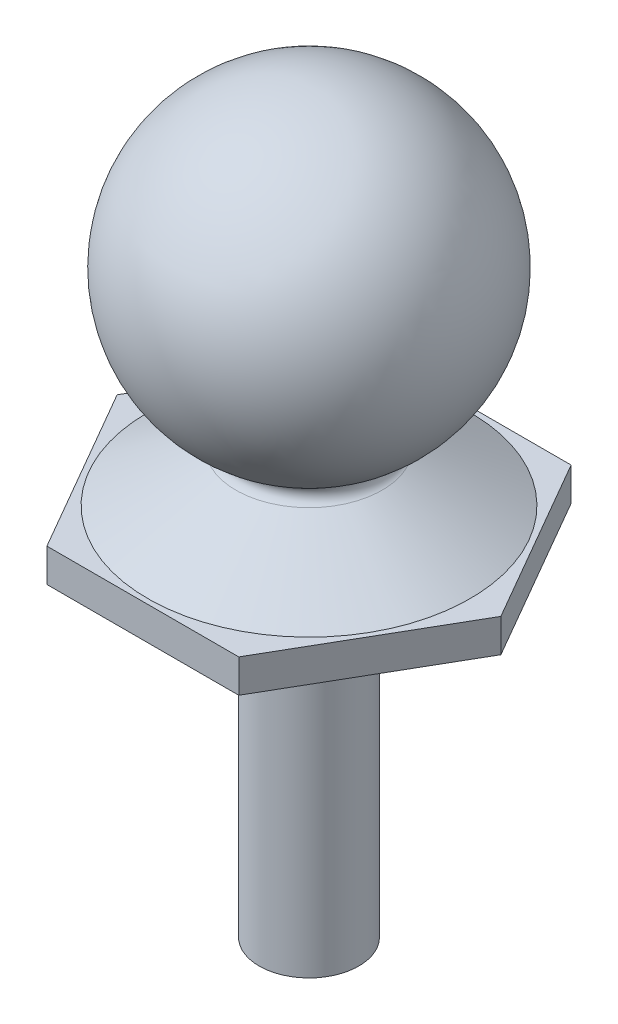
ISO-10303-21;
HEADER;
FILE_DESCRIPTION(('STEP AP214'),'2;1');
FILE_NAME('part.step','',(''),(''),'','','');
FILE_SCHEMA(('AUTOMOTIVE_DESIGN { 1 0 10303 214 1 1 1 1 }'));
ENDSEC;
DATA;
#1=APPLICATION_CONTEXT('core data for automotive mechanical design processes');
#2=APPLICATION_PROTOCOL_DEFINITION('international standard','automotive_design',2000,#1);
#3=PRODUCT_CONTEXT('',#1,'mechanical');
#4=PRODUCT('Part','Part','',(#3));
#5=PRODUCT_RELATED_PRODUCT_CATEGORY('part','',(#4));
#6=PRODUCT_DEFINITION_FORMATION('','',#4);
#7=PRODUCT_DEFINITION_CONTEXT('part definition',#1,'design');
#8=PRODUCT_DEFINITION('design','',#6,#7);
#9=PRODUCT_DEFINITION_SHAPE('','',#8);
#10=(LENGTH_UNIT() NAMED_UNIT(*) SI_UNIT(.MILLI.,.METRE.));
#11=(NAMED_UNIT(*) PLANE_ANGLE_UNIT() SI_UNIT($,.RADIAN.));
#12=(NAMED_UNIT(*) SI_UNIT($,.STERADIAN.) SOLID_ANGLE_UNIT());
#13=UNCERTAINTY_MEASURE_WITH_UNIT(LENGTH_MEASURE(1.E-05),#10,'distance_accuracy_value','');
#14=(GEOMETRIC_REPRESENTATION_CONTEXT(3) GLOBAL_UNCERTAINTY_ASSIGNED_CONTEXT((#13)) GLOBAL_UNIT_ASSIGNED_CONTEXT((#10,
#11,#12)) REPRESENTATION_CONTEXT('',''));
#15=CARTESIAN_POINT('',(0.,0.,0.));
#16=DIRECTION('',(0.,0.,1.));
#17=DIRECTION('',(1.,0.,0.));
#18=AXIS2_PLACEMENT_3D('',#15,#16,#17);
#19=CARTESIAN_POINT('',(0.,-4.43691260265973,0.));
#20=DIRECTION('',(0.,1.,0.));
#21=DIRECTION('',(-1.,0.,0.));
#22=AXIS2_PLACEMENT_3D('',#19,#20,#21);
#23=TOROIDAL_SURFACE('',#22,2.35436537108675,0.313369729864637);
#24=CARTESIAN_POINT('',(0.,-4.1642004470709,0.));
#25=DIRECTION('',(0.,1.,0.));
#26=DIRECTION('',(-1.,0.,0.));
#27=AXIS2_PLACEMENT_3D('',#24,#25,#26);
#28=CIRCLE('',#27,2.20000000000395);
#29=CARTESIAN_POINT('',(-2.20000000000395,-4.1642004470709,0.));
#30=VERTEX_POINT('',#29);
#31=EDGE_CURVE('E129',#30,#30,#28,.T.);
#32=ORIENTED_EDGE('',*,*,#31,.F.);
#33=EDGE_LOOP('',(#32));
#34=FACE_BOUND('',#33,.T.);
#35=CARTESIAN_POINT('',(0.,-4.70962475824633,0.));
#36=DIRECTION('',(0.,1.,0.));
#37=DIRECTION('',(-1.,0.,0.));
#38=AXIS2_PLACEMENT_3D('',#35,#36,#37);
#39=CIRCLE('',#38,2.2);
#40=CARTESIAN_POINT('',(-2.2,-4.70962475824633,0.));
#41=VERTEX_POINT('',#40);
#42=EDGE_CURVE('E11',#41,#41,#39,.T.);
#43=ORIENTED_EDGE('',*,*,#42,.T.);
#44=EDGE_LOOP('',(#43));
#45=FACE_BOUND('',#44,.T.);
#46=ADVANCED_FACE('F32',(#34,#45),#23,.F.);
#47=CARTESIAN_POINT('',(0.,-6.20962475824633,0.));
#48=DIRECTION('',(0.,-1.,0.));
#49=DIRECTION('',(1.,0.,0.));
#50=AXIS2_PLACEMENT_3D('',#47,#48,#49);
#51=CONICAL_SURFACE('',#50,4.85,1.05572350977611);
#52=ORIENTED_EDGE('',*,*,#42,.F.);
#53=EDGE_LOOP('',(#52));
#54=FACE_BOUND('',#53,.T.);
#55=CARTESIAN_POINT('',(0.,-6.20962475824633,0.));
#56=DIRECTION('',(0.,1.,0.));
#57=DIRECTION('',(-1.,0.,0.));
#58=AXIS2_PLACEMENT_3D('',#55,#56,#57);
#59=CIRCLE('',#58,4.85);
#60=CARTESIAN_POINT('',(-4.85,-6.20962475824633,0.));
#61=VERTEX_POINT('',#60);
#62=EDGE_CURVE('E40',#61,#61,#59,.T.);
#63=ORIENTED_EDGE('',*,*,#62,.T.);
#64=EDGE_LOOP('',(#63));
#65=FACE_BOUND('',#64,.T.);
#66=ADVANCED_FACE('F146',(#54,#65),#51,.T.);
#67=CARTESIAN_POINT('',(4.85,-6.20962475824633,0.));
#68=DIRECTION('',(0.,-1.,0.));
#69=DIRECTION('',(1.,0.,0.));
#70=AXIS2_PLACEMENT_3D('',#67,#68,#69);
#71=PLANE('',#70);
#72=ORIENTED_EDGE('',*,*,#62,.F.);
#73=EDGE_LOOP('',(#72));
#74=FACE_BOUND('',#73,.T.);
#75=DIRECTION('',(0.5,0.,-0.866025403784438));
#76=VECTOR('',#75,1.);
#77=CARTESIAN_POINT('',(-5.77350269189626,-6.20962475824633,0.));
#78=LINE('',#77,#76);
#79=CARTESIAN_POINT('',(-5.77350269189626,-6.20962475824633,0.));
#80=VERTEX_POINT('',#79);
#81=CARTESIAN_POINT('',(-2.88675134594813,-6.20962475824633,-5.00000000000001));
#82=VERTEX_POINT('',#81);
#83=EDGE_CURVE('E103',#80,#82,#78,.T.);
#84=ORIENTED_EDGE('',*,*,#83,.F.);
#85=DIRECTION('',(-0.5,0.,-0.866025403784439));
#86=VECTOR('',#85,1.);
#87=CARTESIAN_POINT('',(-2.88675134594813,-6.20962475824633,5.00000000000001));
#88=LINE('',#87,#86);
#89=CARTESIAN_POINT('',(-2.88675134594813,-6.20962475824633,5.00000000000001));
#90=VERTEX_POINT('',#89);
#91=EDGE_CURVE('E93',#90,#80,#88,.T.);
#92=ORIENTED_EDGE('',*,*,#91,.F.);
#93=DIRECTION('',(-1.,0.,0.));
#94=VECTOR('',#93,1.);
#95=CARTESIAN_POINT('',(2.88675134594813,-6.20962475824633,5.00000000000001));
#96=LINE('',#95,#94);
#97=CARTESIAN_POINT('',(2.88675134594813,-6.20962475824633,5.00000000000001));
#98=VERTEX_POINT('',#97);
#99=EDGE_CURVE('E104',#98,#90,#96,.T.);
#100=ORIENTED_EDGE('',*,*,#99,.F.);
#101=DIRECTION('',(-0.5,0.,0.866025403784439));
#102=VECTOR('',#101,1.);
#103=CARTESIAN_POINT('',(5.77350269189626,-6.20962475824633,0.));
#104=LINE('',#103,#102);
#105=CARTESIAN_POINT('',(5.77350269189626,-6.20962475824633,0.));
#106=VERTEX_POINT('',#105);
#107=EDGE_CURVE('E277',#106,#98,#104,.T.);
#108=ORIENTED_EDGE('',*,*,#107,.F.);
#109=DIRECTION('',(0.5,0.,0.866025403784439));
#110=VECTOR('',#109,1.);
#111=CARTESIAN_POINT('',(2.88675134594813,-6.20962475824633,-5.00000000000001));
#112=LINE('',#111,#110);
#113=CARTESIAN_POINT('',(2.88675134594813,-6.20962475824633,-5.00000000000001));
#114=VERTEX_POINT('',#113);
#115=EDGE_CURVE('E81',#114,#106,#112,.T.);
#116=ORIENTED_EDGE('',*,*,#115,.F.);
#117=DIRECTION('',(1.,0.,0.));
#118=VECTOR('',#117,1.);
#119=CARTESIAN_POINT('',(-2.88675134594813,-6.20962475824633,-5.00000000000001));
#120=LINE('',#119,#118);
#121=EDGE_CURVE('E48',#82,#114,#120,.T.);
#122=ORIENTED_EDGE('',*,*,#121,.F.);
#123=EDGE_LOOP('',(#84,#92,#100,#108,#116,#122));
#124=FACE_BOUND('',#123,.T.);
#125=ADVANCED_FACE('F111',(#74,#124),#71,.F.);
#126=CARTESIAN_POINT('',(0.,0.,0.));
#127=DIRECTION('',(0.,1.,0.));
#128=DIRECTION('',(1.,0.,0.));
#129=AXIS2_PLACEMENT_3D('',#126,#127,#128);
#130=SPHERICAL_SURFACE('',#129,4.70962475823742);
#131=ORIENTED_EDGE('',*,*,#31,.T.);
#132=EDGE_LOOP('',(#131));
#133=FACE_BOUND('',#132,.T.);
#134=ADVANCED_FACE('F149',(#133),#130,.T.);
#135=CARTESIAN_POINT('',(2.88675134594813,-6.20962475824633,-5.00000000000001));
#136=DIRECTION('',(0.866025403784439,0.,-0.5));
#137=DIRECTION('',(-0.5,0.,-0.866025403784439));
#138=AXIS2_PLACEMENT_3D('',#135,#136,#137);
#139=PLANE('',#138);
#140=ORIENTED_EDGE('',*,*,#115,.T.);
#141=DIRECTION('',(0.,-1.,0.));
#142=VECTOR('',#141,1.);
#143=CARTESIAN_POINT('',(5.77350269189626,-6.20962475824633,0.));
#144=LINE('',#143,#142);
#145=CARTESIAN_POINT('',(5.77350269189626,-7.20962475824633,0.));
#146=VERTEX_POINT('',#145);
#147=EDGE_CURVE('E113',#106,#146,#144,.T.);
#148=ORIENTED_EDGE('',*,*,#147,.T.);
#149=DIRECTION('',(0.5,0.,0.866025403784439));
#150=VECTOR('',#149,1.);
#151=CARTESIAN_POINT('',(2.88675134594813,-7.20962475824633,-5.00000000000001));
#152=LINE('',#151,#150);
#153=CARTESIAN_POINT('',(2.88675134594813,-7.20962475824633,-5.00000000000001));
#154=VERTEX_POINT('',#153);
#155=EDGE_CURVE('E117',#154,#146,#152,.T.);
#156=ORIENTED_EDGE('',*,*,#155,.F.);
#157=DIRECTION('',(0.,-1.,0.));
#158=VECTOR('',#157,1.);
#159=CARTESIAN_POINT('',(2.88675134594813,-6.20962475824633,-5.00000000000001));
#160=LINE('',#159,#158);
#161=EDGE_CURVE('E127',#114,#154,#160,.T.);
#162=ORIENTED_EDGE('',*,*,#161,.F.);
#163=EDGE_LOOP('',(#140,#148,#156,#162));
#164=FACE_BOUND('',#163,.T.);
#165=ADVANCED_FACE('F155',(#164),#139,.T.);
#166=CARTESIAN_POINT('',(-2.88675134594813,-6.20962475824633,-5.00000000000001));
#167=DIRECTION('',(0.,0.,-1.));
#168=DIRECTION('',(-1.,0.,0.));
#169=AXIS2_PLACEMENT_3D('',#166,#167,#168);
#170=PLANE('',#169);
#171=ORIENTED_EDGE('',*,*,#121,.T.);
#172=ORIENTED_EDGE('',*,*,#161,.T.);
#173=DIRECTION('',(1.,0.,0.));
#174=VECTOR('',#173,1.);
#175=CARTESIAN_POINT('',(-2.88675134594813,-7.20962475824633,-5.00000000000001));
#176=LINE('',#175,#174);
#177=CARTESIAN_POINT('',(-2.88675134594813,-7.20962475824633,-5.00000000000001));
#178=VERTEX_POINT('',#177);
#179=EDGE_CURVE('E74',#178,#154,#176,.T.);
#180=ORIENTED_EDGE('',*,*,#179,.F.);
#181=DIRECTION('',(0.,-1.,0.));
#182=VECTOR('',#181,1.);
#183=CARTESIAN_POINT('',(-2.88675134594813,-6.20962475824633,-5.00000000000001));
#184=LINE('',#183,#182);
#185=EDGE_CURVE('E109',#82,#178,#184,.T.);
#186=ORIENTED_EDGE('',*,*,#185,.F.);
#187=EDGE_LOOP('',(#171,#172,#180,#186));
#188=FACE_BOUND('',#187,.T.);
#189=ADVANCED_FACE('F216',(#188),#170,.T.);
#190=CARTESIAN_POINT('',(-5.77350269189626,-6.20962475824633,0.));
#191=DIRECTION('',(-0.866025403784439,0.,-0.5));
#192=DIRECTION('',(-0.5,0.,0.866025403784439));
#193=AXIS2_PLACEMENT_3D('',#190,#191,#192);
#194=PLANE('',#193);
#195=ORIENTED_EDGE('',*,*,#83,.T.);
#196=ORIENTED_EDGE('',*,*,#185,.T.);
#197=DIRECTION('',(0.5,0.,-0.866025403784438));
#198=VECTOR('',#197,1.);
#199=CARTESIAN_POINT('',(-5.77350269189626,-7.20962475824633,0.));
#200=LINE('',#199,#198);
#201=CARTESIAN_POINT('',(-5.77350269189626,-7.20962475824633,0.));
#202=VERTEX_POINT('',#201);
#203=EDGE_CURVE('E71',#202,#178,#200,.T.);
#204=ORIENTED_EDGE('',*,*,#203,.F.);
#205=DIRECTION('',(0.,-1.,0.));
#206=VECTOR('',#205,1.);
#207=CARTESIAN_POINT('',(-5.77350269189626,-6.20962475824633,0.));
#208=LINE('',#207,#206);
#209=EDGE_CURVE('E97',#80,#202,#208,.T.);
#210=ORIENTED_EDGE('',*,*,#209,.F.);
#211=EDGE_LOOP('',(#195,#196,#204,#210));
#212=FACE_BOUND('',#211,.T.);
#213=ADVANCED_FACE('F107',(#212),#194,.T.);
#214=CARTESIAN_POINT('',(-2.88675134594813,-6.20962475824633,5.00000000000001));
#215=DIRECTION('',(-0.866025403784439,0.,0.5));
#216=DIRECTION('',(0.5,0.,0.866025403784439));
#217=AXIS2_PLACEMENT_3D('',#214,#215,#216);
#218=PLANE('',#217);
#219=ORIENTED_EDGE('',*,*,#91,.T.);
#220=ORIENTED_EDGE('',*,*,#209,.T.);
#221=DIRECTION('',(-0.5,0.,-0.866025403784439));
#222=VECTOR('',#221,1.);
#223=CARTESIAN_POINT('',(-2.88675134594813,-7.20962475824633,5.00000000000001));
#224=LINE('',#223,#222);
#225=CARTESIAN_POINT('',(-2.88675134594813,-7.20962475824633,5.00000000000001));
#226=VERTEX_POINT('',#225);
#227=EDGE_CURVE('E123',#226,#202,#224,.T.);
#228=ORIENTED_EDGE('',*,*,#227,.F.);
#229=DIRECTION('',(0.,-1.,0.));
#230=VECTOR('',#229,1.);
#231=CARTESIAN_POINT('',(-2.88675134594813,-6.20962475824633,5.00000000000001));
#232=LINE('',#231,#230);
#233=EDGE_CURVE('E99',#90,#226,#232,.T.);
#234=ORIENTED_EDGE('',*,*,#233,.F.);
#235=EDGE_LOOP('',(#219,#220,#228,#234));
#236=FACE_BOUND('',#235,.T.);
#237=ADVANCED_FACE('F95',(#236),#218,.T.);
#238=CARTESIAN_POINT('',(2.88675134594813,-6.20962475824633,5.00000000000001));
#239=DIRECTION('',(0.,0.,1.));
#240=DIRECTION('',(1.,0.,0.));
#241=AXIS2_PLACEMENT_3D('',#238,#239,#240);
#242=PLANE('',#241);
#243=ORIENTED_EDGE('',*,*,#99,.T.);
#244=ORIENTED_EDGE('',*,*,#233,.T.);
#245=DIRECTION('',(-1.,0.,0.));
#246=VECTOR('',#245,1.);
#247=CARTESIAN_POINT('',(2.88675134594813,-7.20962475824633,5.00000000000001));
#248=LINE('',#247,#246);
#249=CARTESIAN_POINT('',(2.88675134594813,-7.20962475824633,5.00000000000001));
#250=VERTEX_POINT('',#249);
#251=EDGE_CURVE('E121',#250,#226,#248,.T.);
#252=ORIENTED_EDGE('',*,*,#251,.F.);
#253=DIRECTION('',(0.,-1.,0.));
#254=VECTOR('',#253,1.);
#255=CARTESIAN_POINT('',(2.88675134594813,-6.20962475824633,5.00000000000001));
#256=LINE('',#255,#254);
#257=EDGE_CURVE('E132',#98,#250,#256,.T.);
#258=ORIENTED_EDGE('',*,*,#257,.F.);
#259=EDGE_LOOP('',(#243,#244,#252,#258));
#260=FACE_BOUND('',#259,.T.);
#261=ADVANCED_FACE('F241',(#260),#242,.T.);
#262=CARTESIAN_POINT('',(5.77350269189626,-6.20962475824633,0.));
#263=DIRECTION('',(0.866025403784439,0.,0.5));
#264=DIRECTION('',(0.5,0.,-0.866025403784439));
#265=AXIS2_PLACEMENT_3D('',#262,#263,#264);
#266=PLANE('',#265);
#267=ORIENTED_EDGE('',*,*,#107,.T.);
#268=ORIENTED_EDGE('',*,*,#257,.T.);
#269=DIRECTION('',(-0.5,0.,0.866025403784439));
#270=VECTOR('',#269,1.);
#271=CARTESIAN_POINT('',(5.77350269189626,-7.20962475824633,0.));
#272=LINE('',#271,#270);
#273=EDGE_CURVE('E119',#146,#250,#272,.T.);
#274=ORIENTED_EDGE('',*,*,#273,.F.);
#275=ORIENTED_EDGE('',*,*,#147,.F.);
#276=EDGE_LOOP('',(#267,#268,#274,#275));
#277=FACE_BOUND('',#276,.T.);
#278=ADVANCED_FACE('F195',(#277),#266,.T.);
#279=CARTESIAN_POINT('',(0.,-17.4596247582463,0.));
#280=DIRECTION('',(0.,1.,0.));
#281=DIRECTION('',(-1.,0.,0.));
#282=AXIS2_PLACEMENT_3D('',#279,#280,#281);
#283=PLANE('',#282);
#284=CARTESIAN_POINT('',(0.,-17.4596247582463,0.));
#285=DIRECTION('',(0.,1.,0.));
#286=DIRECTION('',(-1.,0.,0.));
#287=AXIS2_PLACEMENT_3D('',#284,#285,#286);
#288=CIRCLE('',#287,1.5);
#289=CARTESIAN_POINT('',(-1.5,-17.4596247582463,0.));
#290=VERTEX_POINT('',#289);
#291=EDGE_CURVE('E138',#290,#290,#288,.T.);
#292=ORIENTED_EDGE('',*,*,#291,.F.);
#293=EDGE_LOOP('',(#292));
#294=FACE_BOUND('',#293,.T.);
#295=ADVANCED_FACE('F183',(#294),#283,.F.);
#296=CARTESIAN_POINT('',(0.,4.70962475823742,0.));
#297=DIRECTION('',(0.,1.,0.));
#298=DIRECTION('',(-1.,0.,0.));
#299=AXIS2_PLACEMENT_3D('',#296,#297,#298);
#300=CYLINDRICAL_SURFACE('',#299,1.5);
#301=CARTESIAN_POINT('',(0.,-7.20962475824632,0.));
#302=DIRECTION('',(0.,1.,0.));
#303=DIRECTION('',(-1.,0.,0.));
#304=AXIS2_PLACEMENT_3D('',#301,#302,#303);
#305=CIRCLE('',#304,1.5);
#306=CARTESIAN_POINT('',(-1.5,-7.20962475824632,0.));
#307=VERTEX_POINT('',#306);
#308=EDGE_CURVE('E141',#307,#307,#305,.T.);
#309=ORIENTED_EDGE('',*,*,#308,.F.);
#310=EDGE_LOOP('',(#309));
#311=FACE_BOUND('',#310,.T.);
#312=ORIENTED_EDGE('',*,*,#291,.T.);
#313=EDGE_LOOP('',(#312));
#314=FACE_BOUND('',#313,.T.);
#315=ADVANCED_FACE('F177',(#311,#314),#300,.T.);
#316=CARTESIAN_POINT('',(1.5,-7.20962475824633,0.));
#317=DIRECTION('',(0.,1.,0.));
#318=DIRECTION('',(-1.,0.,0.));
#319=AXIS2_PLACEMENT_3D('',#316,#317,#318);
#320=PLANE('',#319);
#321=ORIENTED_EDGE('',*,*,#203,.T.);
#322=ORIENTED_EDGE('',*,*,#179,.T.);
#323=ORIENTED_EDGE('',*,*,#155,.T.);
#324=ORIENTED_EDGE('',*,*,#273,.T.);
#325=ORIENTED_EDGE('',*,*,#251,.T.);
#326=ORIENTED_EDGE('',*,*,#227,.T.);
#327=EDGE_LOOP('',(#321,#322,#323,#324,#325,#326));
#328=FACE_BOUND('',#327,.T.);
#329=ORIENTED_EDGE('',*,*,#308,.T.);
#330=EDGE_LOOP('',(#329));
#331=FACE_BOUND('',#330,.T.);
#332=ADVANCED_FACE('F182',(#328,#331),#320,.F.);
#333=CLOSED_SHELL('',(#46,#66,#125,#134,#165,#189,#213,#237,#261,#278,#295,#315,#332));
#334=MANIFOLD_SOLID_BREP('B2',#333);
#335=ADVANCED_BREP_SHAPE_REPRESENTATION('',(#18,#334),#14);
#336=SHAPE_DEFINITION_REPRESENTATION(#9,#335);
ENDSEC;
END-ISO-10303-21;
